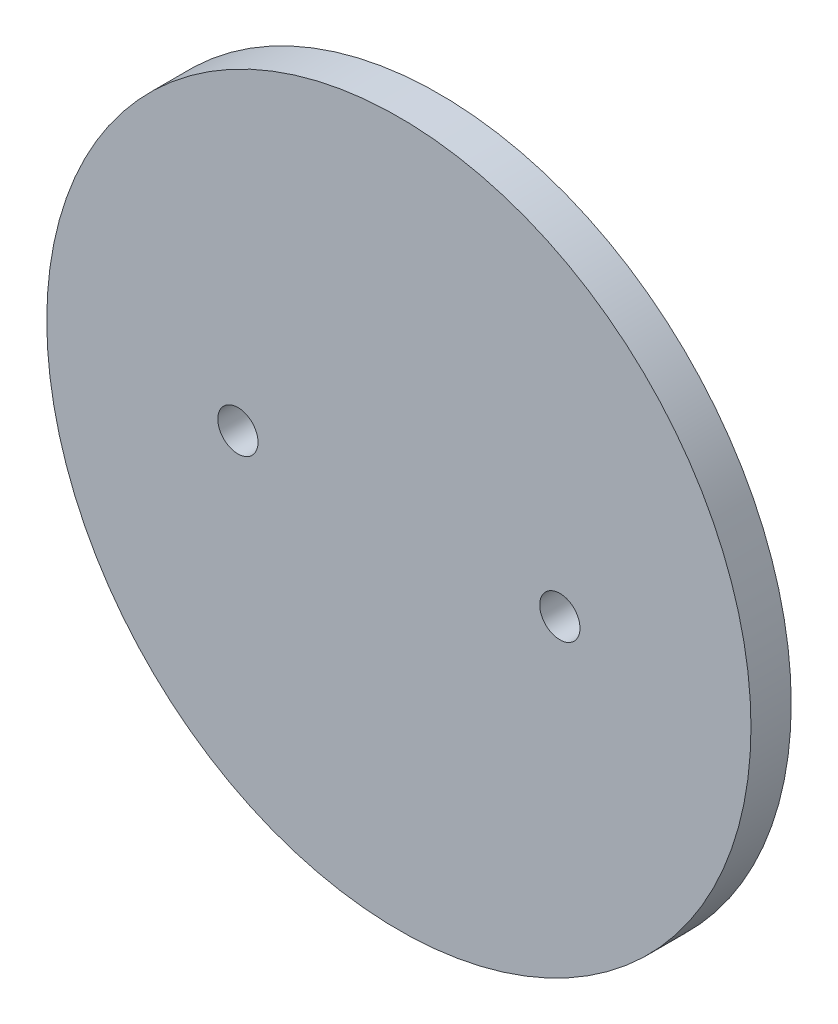
ISO-10303-21;
HEADER;
FILE_DESCRIPTION(('STEP AP214'),'2;1');
FILE_NAME('part.step','',(''),(''),'','','');
FILE_SCHEMA(('AUTOMOTIVE_DESIGN { 1 0 10303 214 1 1 1 1 }'));
ENDSEC;
DATA;
#1=APPLICATION_CONTEXT('core data for automotive mechanical design processes');
#2=APPLICATION_PROTOCOL_DEFINITION('international standard','automotive_design',2000,#1);
#3=PRODUCT_CONTEXT('',#1,'mechanical');
#4=PRODUCT('Part','Part','',(#3));
#5=PRODUCT_RELATED_PRODUCT_CATEGORY('part','',(#4));
#6=PRODUCT_DEFINITION_FORMATION('','',#4);
#7=PRODUCT_DEFINITION_CONTEXT('part definition',#1,'design');
#8=PRODUCT_DEFINITION('design','',#6,#7);
#9=PRODUCT_DEFINITION_SHAPE('','',#8);
#10=(LENGTH_UNIT() NAMED_UNIT(*) SI_UNIT(.MILLI.,.METRE.));
#11=(NAMED_UNIT(*) PLANE_ANGLE_UNIT() SI_UNIT($,.RADIAN.));
#12=(NAMED_UNIT(*) SI_UNIT($,.STERADIAN.) SOLID_ANGLE_UNIT());
#13=UNCERTAINTY_MEASURE_WITH_UNIT(LENGTH_MEASURE(1.E-05),#10,'distance_accuracy_value','');
#14=(GEOMETRIC_REPRESENTATION_CONTEXT(3) GLOBAL_UNCERTAINTY_ASSIGNED_CONTEXT((#13)) GLOBAL_UNIT_ASSIGNED_CONTEXT((#10,
#11,#12)) REPRESENTATION_CONTEXT('',''));
#15=CARTESIAN_POINT('',(0.,0.,0.));
#16=DIRECTION('',(0.,0.,1.));
#17=DIRECTION('',(1.,0.,0.));
#18=AXIS2_PLACEMENT_3D('',#15,#16,#17);
#19=CARTESIAN_POINT('',(0.,0.,2.54));
#20=DIRECTION('',(0.,0.,-1.));
#21=DIRECTION('',(-1.,0.,0.));
#22=AXIS2_PLACEMENT_3D('',#19,#20,#21);
#23=CYLINDRICAL_SURFACE('',#22,22.225);
#24=CARTESIAN_POINT('',(0.,0.,2.54));
#25=DIRECTION('',(0.,0.,1.));
#26=DIRECTION('',(1.,0.,0.));
#27=AXIS2_PLACEMENT_3D('',#24,#25,#26);
#28=CIRCLE('',#27,22.225);
#29=CARTESIAN_POINT('',(22.225,0.,2.54));
#30=VERTEX_POINT('',#29);
#31=EDGE_CURVE('E10',#30,#30,#28,.T.);
#32=ORIENTED_EDGE('',*,*,#31,.F.);
#33=EDGE_LOOP('',(#32));
#34=FACE_BOUND('',#33,.T.);
#35=CARTESIAN_POINT('',(0.,0.,0.));
#36=DIRECTION('',(0.,0.,1.));
#37=DIRECTION('',(1.,0.,0.));
#38=AXIS2_PLACEMENT_3D('',#35,#36,#37);
#39=CIRCLE('',#38,22.225);
#40=CARTESIAN_POINT('',(22.225,0.,0.));
#41=VERTEX_POINT('',#40);
#42=EDGE_CURVE('E34',#41,#41,#39,.T.);
#43=ORIENTED_EDGE('',*,*,#42,.T.);
#44=EDGE_LOOP('',(#43));
#45=FACE_BOUND('',#44,.T.);
#46=ADVANCED_FACE('F31',(#34,#45),#23,.T.);
#47=CARTESIAN_POINT('',(0.,0.,2.54));
#48=DIRECTION('',(0.,0.,1.));
#49=DIRECTION('',(1.,0.,0.));
#50=AXIS2_PLACEMENT_3D('',#47,#48,#49);
#51=PLANE('',#50);
#52=CARTESIAN_POINT('',(-10.16,0.,2.54));
#53=DIRECTION('',(0.,0.,1.));
#54=DIRECTION('',(1.,0.,0.));
#55=AXIS2_PLACEMENT_3D('',#52,#53,#54);
#56=CIRCLE('',#55,1.27);
#57=CARTESIAN_POINT('',(-8.89,0.,2.54));
#58=VERTEX_POINT('',#57);
#59=EDGE_CURVE('E49',#58,#58,#56,.T.);
#60=ORIENTED_EDGE('',*,*,#59,.F.);
#61=EDGE_LOOP('',(#60));
#62=FACE_BOUND('',#61,.T.);
#63=CARTESIAN_POINT('',(10.16,0.,2.54));
#64=DIRECTION('',(0.,0.,1.));
#65=DIRECTION('',(1.,0.,0.));
#66=AXIS2_PLACEMENT_3D('',#63,#64,#65);
#67=CIRCLE('',#66,1.27);
#68=CARTESIAN_POINT('',(11.43,0.,2.54));
#69=VERTEX_POINT('',#68);
#70=EDGE_CURVE('E43',#69,#69,#67,.T.);
#71=ORIENTED_EDGE('',*,*,#70,.F.);
#72=EDGE_LOOP('',(#71));
#73=FACE_BOUND('',#72,.T.);
#74=ORIENTED_EDGE('',*,*,#31,.T.);
#75=EDGE_LOOP('',(#74));
#76=FACE_BOUND('',#75,.T.);
#77=ADVANCED_FACE('F65',(#62,#73,#76),#51,.T.);
#78=CARTESIAN_POINT('',(0.,0.,0.));
#79=DIRECTION('',(0.,0.,1.));
#80=DIRECTION('',(1.,0.,0.));
#81=AXIS2_PLACEMENT_3D('',#78,#79,#80);
#82=PLANE('',#81);
#83=CARTESIAN_POINT('',(-10.16,0.,0.));
#84=DIRECTION('',(0.,0.,1.));
#85=DIRECTION('',(1.,0.,0.));
#86=AXIS2_PLACEMENT_3D('',#83,#84,#85);
#87=CIRCLE('',#86,1.27);
#88=CARTESIAN_POINT('',(-8.89,0.,0.));
#89=VERTEX_POINT('',#88);
#90=EDGE_CURVE('E41',#89,#89,#87,.T.);
#91=ORIENTED_EDGE('',*,*,#90,.T.);
#92=EDGE_LOOP('',(#91));
#93=FACE_BOUND('',#92,.T.);
#94=CARTESIAN_POINT('',(10.16,0.,0.));
#95=DIRECTION('',(0.,0.,1.));
#96=DIRECTION('',(1.,0.,0.));
#97=AXIS2_PLACEMENT_3D('',#94,#95,#96);
#98=CIRCLE('',#97,1.27);
#99=CARTESIAN_POINT('',(11.43,0.,0.));
#100=VERTEX_POINT('',#99);
#101=EDGE_CURVE('E46',#100,#100,#98,.T.);
#102=ORIENTED_EDGE('',*,*,#101,.T.);
#103=EDGE_LOOP('',(#102));
#104=FACE_BOUND('',#103,.T.);
#105=ORIENTED_EDGE('',*,*,#42,.F.);
#106=EDGE_LOOP('',(#105));
#107=FACE_BOUND('',#106,.T.);
#108=ADVANCED_FACE('F55',(#93,#104,#107),#82,.F.);
#109=CARTESIAN_POINT('',(10.16,0.,0.));
#110=DIRECTION('',(0.,0.,1.));
#111=DIRECTION('',(1.,0.,0.));
#112=AXIS2_PLACEMENT_3D('',#109,#110,#111);
#113=CYLINDRICAL_SURFACE('',#112,1.27);
#114=ORIENTED_EDGE('',*,*,#101,.F.);
#115=EDGE_LOOP('',(#114));
#116=FACE_BOUND('',#115,.T.);
#117=ORIENTED_EDGE('',*,*,#70,.T.);
#118=EDGE_LOOP('',(#117));
#119=FACE_BOUND('',#118,.T.);
#120=ADVANCED_FACE('F61',(#116,#119),#113,.F.);
#121=CARTESIAN_POINT('',(-10.16,0.,0.));
#122=DIRECTION('',(0.,0.,1.));
#123=DIRECTION('',(1.,0.,0.));
#124=AXIS2_PLACEMENT_3D('',#121,#122,#123);
#125=CYLINDRICAL_SURFACE('',#124,1.27);
#126=ORIENTED_EDGE('',*,*,#90,.F.);
#127=EDGE_LOOP('',(#126));
#128=FACE_BOUND('',#127,.T.);
#129=ORIENTED_EDGE('',*,*,#59,.T.);
#130=EDGE_LOOP('',(#129));
#131=FACE_BOUND('',#130,.T.);
#132=ADVANCED_FACE('F58',(#128,#131),#125,.F.);
#133=CLOSED_SHELL('',(#46,#77,#108,#120,#132));
#134=MANIFOLD_SOLID_BREP('B2',#133);
#135=ADVANCED_BREP_SHAPE_REPRESENTATION('',(#18,#134),#14);
#136=SHAPE_DEFINITION_REPRESENTATION(#9,#135);
ENDSEC;
END-ISO-10303-21;
